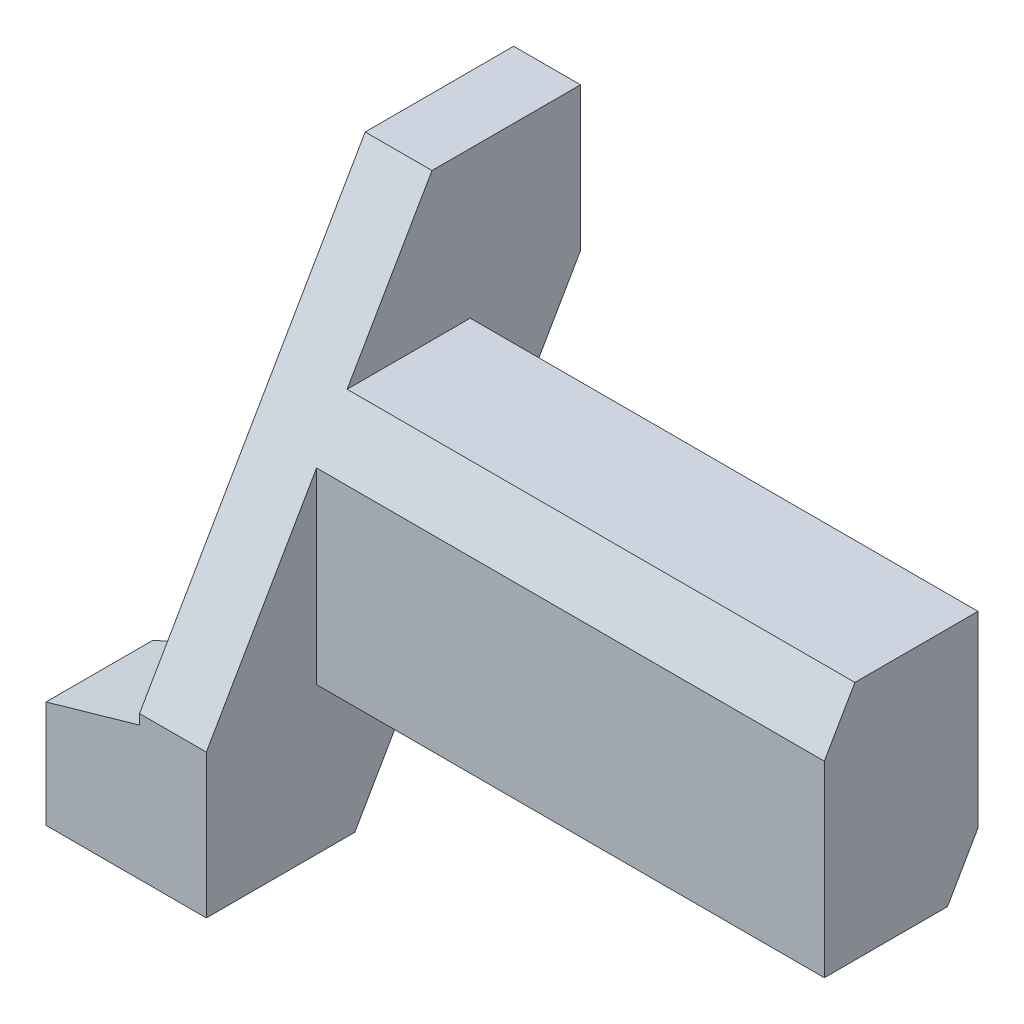
ISO-10303-21;
HEADER;
FILE_DESCRIPTION(('STEP AP214'),'2;1');
FILE_NAME('part.step','',(''),(''),'','','');
FILE_SCHEMA(('AUTOMOTIVE_DESIGN { 1 0 10303 214 1 1 1 1 }'));
ENDSEC;
DATA;
#1=APPLICATION_CONTEXT('core data for automotive mechanical design processes');
#2=APPLICATION_PROTOCOL_DEFINITION('international standard','automotive_design',2000,#1);
#3=PRODUCT_CONTEXT('',#1,'mechanical');
#4=PRODUCT('Part','Part','',(#3));
#5=PRODUCT_RELATED_PRODUCT_CATEGORY('part','',(#4));
#6=PRODUCT_DEFINITION_FORMATION('','',#4);
#7=PRODUCT_DEFINITION_CONTEXT('part definition',#1,'design');
#8=PRODUCT_DEFINITION('design','',#6,#7);
#9=PRODUCT_DEFINITION_SHAPE('','',#8);
#10=(LENGTH_UNIT() NAMED_UNIT(*) SI_UNIT(.MILLI.,.METRE.));
#11=(NAMED_UNIT(*) PLANE_ANGLE_UNIT() SI_UNIT($,.RADIAN.));
#12=(NAMED_UNIT(*) SI_UNIT($,.STERADIAN.) SOLID_ANGLE_UNIT());
#13=UNCERTAINTY_MEASURE_WITH_UNIT(LENGTH_MEASURE(1.E-05),#10,'distance_accuracy_value','');
#14=(GEOMETRIC_REPRESENTATION_CONTEXT(3) GLOBAL_UNCERTAINTY_ASSIGNED_CONTEXT((#13)) GLOBAL_UNIT_ASSIGNED_CONTEXT((#10,
#11,#12)) REPRESENTATION_CONTEXT('',''));
#15=CARTESIAN_POINT('',(0.,0.,0.));
#16=DIRECTION('',(0.,0.,1.));
#17=DIRECTION('',(1.,0.,0.));
#18=AXIS2_PLACEMENT_3D('',#15,#16,#17);
#19=CARTESIAN_POINT('',(0.,0.,0.));
#20=DIRECTION('',(-1.,0.,0.));
#21=DIRECTION('',(0.,0.,1.));
#22=AXIS2_PLACEMENT_3D('',#19,#20,#21);
#23=PLANE('',#22);
#24=DIRECTION('',(0.,0.,-1.));
#25=VECTOR('',#24,1.);
#26=CARTESIAN_POINT('',(0.,-18.,11.5));
#27=LINE('',#26,#25);
#28=CARTESIAN_POINT('',(0.,-18.,11.5));
#29=VERTEX_POINT('',#28);
#30=CARTESIAN_POINT('',(0.,-18.,-6.92820323027691));
#31=VERTEX_POINT('',#30);
#32=EDGE_CURVE('E59',#29,#31,#27,.T.);
#33=ORIENTED_EDGE('',*,*,#32,.F.);
#34=DIRECTION('',(0.,-1.,0.));
#35=VECTOR('',#34,1.);
#36=CARTESIAN_POINT('',(0.,-18.,11.5));
#37=LINE('',#36,#35);
#38=CARTESIAN_POINT('',(0.,10.0814157129556,11.5));
#39=VERTEX_POINT('',#38);
#40=EDGE_CURVE('E196',#39,#29,#37,.T.);
#41=ORIENTED_EDGE('',*,*,#40,.F.);
#42=DIRECTION('',(0.,-0.86602540378444,0.499999999999998));
#43=VECTOR('',#42,1.);
#44=CARTESIAN_POINT('',(0.,-18.497422611931,28.));
#45=LINE('',#44,#43);
#46=CARTESIAN_POINT('',(0.,-18.497422611931,28.));
#47=VERTEX_POINT('',#46);
#48=EDGE_CURVE('E233',#39,#47,#45,.T.);
#49=ORIENTED_EDGE('',*,*,#48,.T.);
#50=DIRECTION('',(0.,-1.,0.));
#51=VECTOR('',#50,1.);
#52=CARTESIAN_POINT('',(0.,-40.0000000000004,28.));
#53=LINE('',#52,#51);
#54=CARTESIAN_POINT('',(0.,-40.0000000000004,28.));
#55=VERTEX_POINT('',#54);
#56=EDGE_CURVE('E219',#47,#55,#53,.T.);
#57=ORIENTED_EDGE('',*,*,#56,.T.);
#58=DIRECTION('',(0.,0.,-1.));
#59=VECTOR('',#58,1.);
#60=CARTESIAN_POINT('',(0.,-39.9999999999998,5.77350269189466));
#61=LINE('',#60,#59);
#62=CARTESIAN_POINT('',(0.,-39.9999999999998,5.77350269189466));
#63=VERTEX_POINT('',#62);
#64=EDGE_CURVE('E216',#55,#63,#61,.T.);
#65=ORIENTED_EDGE('',*,*,#64,.T.);
#66=DIRECTION('',(0.,0.86602540378444,-0.499999999999998));
#67=VECTOR('',#66,1.);
#68=CARTESIAN_POINT('',(0.,-39.9999999999998,5.77350269189466));
#69=LINE('',#68,#67);
#70=EDGE_CURVE('E225',#63,#31,#69,.T.);
#71=ORIENTED_EDGE('',*,*,#70,.T.);
#72=EDGE_LOOP('',(#33,#41,#49,#57,#65,#71));
#73=FACE_BOUND('',#72,.T.);
#74=ADVANCED_FACE('F36',(#73),#23,.F.);
#75=DIRECTION('',(0.,1.,0.));
#76=VECTOR('',#75,1.);
#77=CARTESIAN_POINT('',(0.,-10.0814157129605,-11.5));
#78=LINE('',#77,#76);
#79=CARTESIAN_POINT('',(0.,-10.0814157129603,-11.5));
#80=VERTEX_POINT('',#79);
#81=CARTESIAN_POINT('',(0.,18.,-11.5));
#82=VERTEX_POINT('',#81);
#83=EDGE_CURVE('E176',#80,#82,#78,.T.);
#84=ORIENTED_EDGE('',*,*,#83,.F.);
#85=CARTESIAN_POINT('',(0.,18.4974226119264,-28.));
#86=VERTEX_POINT('',#85);
#87=EDGE_CURVE('E224',#80,#86,#69,.T.);
#88=ORIENTED_EDGE('',*,*,#87,.T.);
#89=DIRECTION('',(0.,1.,0.));
#90=VECTOR('',#89,1.);
#91=CARTESIAN_POINT('',(0.,18.4974226119264,-28.));
#92=LINE('',#91,#90);
#93=CARTESIAN_POINT('',(0.,40.,-28.));
#94=VERTEX_POINT('',#93);
#95=EDGE_CURVE('E227',#86,#94,#92,.T.);
#96=ORIENTED_EDGE('',*,*,#95,.T.);
#97=DIRECTION('',(0.,0.,1.));
#98=VECTOR('',#97,1.);
#99=CARTESIAN_POINT('',(0.,40.0000000000002,-5.77350269189761));
#100=LINE('',#99,#98);
#101=CARTESIAN_POINT('',(0.,40.0000000000002,-5.77350269189761));
#102=VERTEX_POINT('',#101);
#103=EDGE_CURVE('E230',#94,#102,#100,.T.);
#104=ORIENTED_EDGE('',*,*,#103,.T.);
#105=CARTESIAN_POINT('',(0.,18.,6.92820323027427));
#106=VERTEX_POINT('',#105);
#107=EDGE_CURVE('E234',#102,#106,#45,.T.);
#108=ORIENTED_EDGE('',*,*,#107,.T.);
#109=DIRECTION('',(0.,0.,1.));
#110=VECTOR('',#109,1.);
#111=CARTESIAN_POINT('',(0.,18.,6.92820323027427));
#112=LINE('',#111,#110);
#113=EDGE_CURVE('E193',#82,#106,#112,.T.);
#114=ORIENTED_EDGE('',*,*,#113,.F.);
#115=EDGE_LOOP('',(#84,#88,#96,#104,#108,#114));
#116=FACE_BOUND('',#115,.T.);
#117=ADVANCED_FACE('F277',(#116),#23,.F.);
#118=CARTESIAN_POINT('',(-24.,-39.9999999999998,5.77350269189466));
#119=DIRECTION('',(0.,-1.,0.));
#120=DIRECTION('',(0.,0.,-1.));
#121=AXIS2_PLACEMENT_3D('',#118,#119,#120);
#122=PLANE('',#121);
#123=DIRECTION('',(-0.961523947640823,0.,0.274721127897378));
#124=VECTOR('',#123,1.);
#125=CARTESIAN_POINT('',(-22.35526486201,-40.,11.5300756748596));
#126=LINE('',#125,#124);
#127=CARTESIAN_POINT('',(-9.99999999999999,-39.9999999999998,7.99999999999955));
#128=VERTEX_POINT('',#127);
#129=CARTESIAN_POINT('',(-24.,-40.0000000000004,11.9999999999996));
#130=VERTEX_POINT('',#129);
#131=EDGE_CURVE('E147',#128,#130,#126,.T.);
#132=ORIENTED_EDGE('',*,*,#131,.F.);
#133=DIRECTION('',(0.,0.,1.));
#134=VECTOR('',#133,1.);
#135=CARTESIAN_POINT('',(-9.99999999999999,-39.9999999999998,5.77350269189467));
#136=LINE('',#135,#134);
#137=CARTESIAN_POINT('',(-9.99999999999999,-39.9999999999998,5.77350269189466));
#138=VERTEX_POINT('',#137);
#139=EDGE_CURVE('E141',#138,#128,#136,.T.);
#140=ORIENTED_EDGE('',*,*,#139,.F.);
#141=DIRECTION('',(1.,0.,0.));
#142=VECTOR('',#141,1.);
#143=CARTESIAN_POINT('',(-24.,-39.9999999999998,5.77350269189466));
#144=LINE('',#143,#142);
#145=EDGE_CURVE('E221',#138,#63,#144,.T.);
#146=ORIENTED_EDGE('',*,*,#145,.T.);
#147=ORIENTED_EDGE('',*,*,#64,.F.);
#148=DIRECTION('',(1.,0.,0.));
#149=VECTOR('',#148,1.);
#150=CARTESIAN_POINT('',(-24.,-40.0000000000004,28.));
#151=LINE('',#150,#149);
#152=CARTESIAN_POINT('',(-24.,-40.0000000000004,28.));
#153=VERTEX_POINT('',#152);
#154=EDGE_CURVE('E238',#153,#55,#151,.T.);
#155=ORIENTED_EDGE('',*,*,#154,.F.);
#156=DIRECTION('',(0.,0.,-1.));
#157=VECTOR('',#156,1.);
#158=CARTESIAN_POINT('',(-24.,-39.9999999999998,5.77350269189466));
#159=LINE('',#158,#157);
#160=EDGE_CURVE('E158',#153,#130,#159,.T.);
#161=ORIENTED_EDGE('',*,*,#160,.T.);
#162=EDGE_LOOP('',(#132,#140,#146,#147,#155,#161));
#163=FACE_BOUND('',#162,.T.);
#164=ADVANCED_FACE('F38',(#163),#122,.T.);
#165=CARTESIAN_POINT('',(-24.,-40.0000000000004,28.));
#166=DIRECTION('',(0.,0.,1.));
#167=DIRECTION('',(0.,-1.,0.));
#168=AXIS2_PLACEMENT_3D('',#165,#166,#167);
#169=PLANE('',#168);
#170=DIRECTION('',(0.,1.,0.));
#171=VECTOR('',#170,1.);
#172=CARTESIAN_POINT('',(-9.99999999999999,-40.0000000000004,28.));
#173=LINE('',#172,#171);
#174=CARTESIAN_POINT('',(-9.99999999999999,-20.0000000000004,28.));
#175=VERTEX_POINT('',#174);
#176=CARTESIAN_POINT('',(-9.99999999999999,-18.497422611931,28.));
#177=VERTEX_POINT('',#176);
#178=EDGE_CURVE('E174',#175,#177,#173,.T.);
#179=ORIENTED_EDGE('',*,*,#178,.F.);
#180=DIRECTION('',(0.961523947640823,0.274721127897378,0.));
#181=VECTOR('',#180,1.);
#182=CARTESIAN_POINT('',(-28.2264150943396,-25.2075471698117,28.));
#183=LINE('',#182,#181);
#184=CARTESIAN_POINT('',(-24.,-24.0000000000004,28.));
#185=VERTEX_POINT('',#184);
#186=EDGE_CURVE('E168',#185,#175,#183,.T.);
#187=ORIENTED_EDGE('',*,*,#186,.F.);
#188=DIRECTION('',(0.,-1.,0.));
#189=VECTOR('',#188,1.);
#190=CARTESIAN_POINT('',(-24.,-40.0000000000004,28.));
#191=LINE('',#190,#189);
#192=EDGE_CURVE('E218',#185,#153,#191,.T.);
#193=ORIENTED_EDGE('',*,*,#192,.T.);
#194=ORIENTED_EDGE('',*,*,#154,.T.);
#195=ORIENTED_EDGE('',*,*,#56,.F.);
#196=DIRECTION('',(1.,0.,0.));
#197=VECTOR('',#196,1.);
#198=CARTESIAN_POINT('',(-24.,-18.497422611931,28.));
#199=LINE('',#198,#197);
#200=EDGE_CURVE('E241',#177,#47,#199,.T.);
#201=ORIENTED_EDGE('',*,*,#200,.F.);
#202=EDGE_LOOP('',(#179,#187,#193,#194,#195,#201));
#203=FACE_BOUND('',#202,.T.);
#204=ADVANCED_FACE('F258',(#203),#169,.T.);
#205=CARTESIAN_POINT('',(-24.,-18.497422611931,28.));
#206=DIRECTION('',(0.,0.499999999999998,0.86602540378444));
#207=DIRECTION('',(0.,-0.86602540378444,0.499999999999998));
#208=AXIS2_PLACEMENT_3D('',#205,#206,#207);
#209=PLANE('',#208);
#210=DIRECTION('',(0.,0.86602540378444,-0.499999999999998));
#211=VECTOR('',#210,1.);
#212=CARTESIAN_POINT('',(-9.99999999999999,-18.497422611931,28.));
#213=LINE('',#212,#211);
#214=CARTESIAN_POINT('',(-10.,40.0000000000002,-5.77350269189762));
#215=VERTEX_POINT('',#214);
#216=EDGE_CURVE('E172',#177,#215,#213,.T.);
#217=ORIENTED_EDGE('',*,*,#216,.F.);
#218=ORIENTED_EDGE('',*,*,#200,.T.);
#219=ORIENTED_EDGE('',*,*,#48,.F.);
#220=DIRECTION('',(-1.,0.,0.));
#221=VECTOR('',#220,1.);
#222=CARTESIAN_POINT('',(76.,10.0814157129558,11.5));
#223=LINE('',#222,#221);
#224=CARTESIAN_POINT('',(76.,10.0814157129558,11.5));
#225=VERTEX_POINT('',#224);
#226=EDGE_CURVE('E207',#225,#39,#223,.T.);
#227=ORIENTED_EDGE('',*,*,#226,.F.);
#228=DIRECTION('',(0.,-0.866025403784439,0.5));
#229=VECTOR('',#228,1.);
#230=CARTESIAN_POINT('',(76.,18.,6.92820323027427));
#231=LINE('',#230,#229);
#232=CARTESIAN_POINT('',(76.,18.,6.92820323027427));
#233=VERTEX_POINT('',#232);
#234=EDGE_CURVE('E182',#233,#225,#231,.T.);
#235=ORIENTED_EDGE('',*,*,#234,.F.);
#236=DIRECTION('',(-1.,0.,0.));
#237=VECTOR('',#236,1.);
#238=CARTESIAN_POINT('',(76.,18.,6.92820323027427));
#239=LINE('',#238,#237);
#240=EDGE_CURVE('E210',#233,#106,#239,.T.);
#241=ORIENTED_EDGE('',*,*,#240,.T.);
#242=ORIENTED_EDGE('',*,*,#107,.F.);
#243=DIRECTION('',(1.,0.,0.));
#244=VECTOR('',#243,1.);
#245=CARTESIAN_POINT('',(-24.,40.0000000000002,-5.77350269189761));
#246=LINE('',#245,#244);
#247=EDGE_CURVE('E243',#215,#102,#246,.T.);
#248=ORIENTED_EDGE('',*,*,#247,.F.);
#249=EDGE_LOOP('',(#217,#218,#219,#227,#235,#241,#242,#248));
#250=FACE_BOUND('',#249,.T.);
#251=ADVANCED_FACE('F285',(#250),#209,.T.);
#252=CARTESIAN_POINT('',(-24.,40.0000000000002,-5.77350269189761));
#253=DIRECTION('',(0.,1.,0.));
#254=DIRECTION('',(0.,0.,1.));
#255=AXIS2_PLACEMENT_3D('',#252,#253,#254);
#256=PLANE('',#255);
#257=DIRECTION('',(0.,0.,1.));
#258=VECTOR('',#257,1.);
#259=CARTESIAN_POINT('',(-10.,40.0000000000002,-28.));
#260=LINE('',#259,#258);
#261=CARTESIAN_POINT('',(-10.,40.0000000000002,-28.));
#262=VERTEX_POINT('',#261);
#263=EDGE_CURVE('E165',#262,#215,#260,.T.);
#264=ORIENTED_EDGE('',*,*,#263,.T.);
#265=ORIENTED_EDGE('',*,*,#247,.T.);
#266=ORIENTED_EDGE('',*,*,#103,.F.);
#267=DIRECTION('',(1.,0.,0.));
#268=VECTOR('',#267,1.);
#269=CARTESIAN_POINT('',(-24.,40.,-28.));
#270=LINE('',#269,#268);
#271=EDGE_CURVE('E245',#262,#94,#270,.T.);
#272=ORIENTED_EDGE('',*,*,#271,.F.);
#273=EDGE_LOOP('',(#264,#265,#266,#272));
#274=FACE_BOUND('',#273,.T.);
#275=ADVANCED_FACE('F288',(#274),#256,.T.);
#276=CARTESIAN_POINT('',(-24.,18.4974226119264,-28.));
#277=DIRECTION('',(0.,0.,-1.));
#278=DIRECTION('',(0.,1.,0.));
#279=AXIS2_PLACEMENT_3D('',#276,#277,#278);
#280=PLANE('',#279);
#281=DIRECTION('',(0.,1.,0.));
#282=VECTOR('',#281,1.);
#283=CARTESIAN_POINT('',(-10.,40.0000000000002,-28.));
#284=LINE('',#283,#282);
#285=CARTESIAN_POINT('',(-9.99999999999999,18.4974226119264,-28.));
#286=VERTEX_POINT('',#285);
#287=EDGE_CURVE('E159',#286,#262,#284,.T.);
#288=ORIENTED_EDGE('',*,*,#287,.T.);
#289=ORIENTED_EDGE('',*,*,#271,.T.);
#290=ORIENTED_EDGE('',*,*,#95,.F.);
#291=DIRECTION('',(1.,0.,0.));
#292=VECTOR('',#291,1.);
#293=CARTESIAN_POINT('',(-24.,18.4974226119264,-28.));
#294=LINE('',#293,#292);
#295=EDGE_CURVE('E247',#286,#86,#294,.T.);
#296=ORIENTED_EDGE('',*,*,#295,.F.);
#297=EDGE_LOOP('',(#288,#289,#290,#296));
#298=FACE_BOUND('',#297,.T.);
#299=ADVANCED_FACE('F273',(#298),#280,.T.);
#300=CARTESIAN_POINT('',(-24.,-39.9999999999998,5.77350269189466));
#301=DIRECTION('',(0.,-0.499999999999998,-0.86602540378444));
#302=DIRECTION('',(0.,0.86602540378444,-0.499999999999998));
#303=AXIS2_PLACEMENT_3D('',#300,#301,#302);
#304=PLANE('',#303);
#305=ORIENTED_EDGE('',*,*,#145,.F.);
#306=DIRECTION('',(0.,-0.86602540378444,0.499999999999998));
#307=VECTOR('',#306,1.);
#308=CARTESIAN_POINT('',(-9.99999999999999,-39.9999999999998,5.77350269189466));
#309=LINE('',#308,#307);
#310=EDGE_CURVE('E44',#286,#138,#309,.T.);
#311=ORIENTED_EDGE('',*,*,#310,.F.);
#312=ORIENTED_EDGE('',*,*,#295,.T.);
#313=ORIENTED_EDGE('',*,*,#87,.F.);
#314=DIRECTION('',(-1.,0.,0.));
#315=VECTOR('',#314,1.);
#316=CARTESIAN_POINT('',(76.,-10.0814157129605,-11.5));
#317=LINE('',#316,#315);
#318=CARTESIAN_POINT('',(76.,-10.0814157129605,-11.5));
#319=VERTEX_POINT('',#318);
#320=EDGE_CURVE('E190',#319,#80,#317,.T.);
#321=ORIENTED_EDGE('',*,*,#320,.F.);
#322=DIRECTION('',(0.,0.866025403784438,-0.5));
#323=VECTOR('',#322,1.);
#324=CARTESIAN_POINT('',(76.,-10.0814157129605,-11.5));
#325=LINE('',#324,#323);
#326=CARTESIAN_POINT('',(76.,-18.,-6.92820323027698));
#327=VERTEX_POINT('',#326);
#328=EDGE_CURVE('E188',#327,#319,#325,.T.);
#329=ORIENTED_EDGE('',*,*,#328,.F.);
#330=DIRECTION('',(-1.,0.,0.));
#331=VECTOR('',#330,1.);
#332=CARTESIAN_POINT('',(76.,-18.,-6.92820323027698));
#333=LINE('',#332,#331);
#334=EDGE_CURVE('E201',#327,#31,#333,.T.);
#335=ORIENTED_EDGE('',*,*,#334,.T.);
#336=ORIENTED_EDGE('',*,*,#70,.F.);
#337=EDGE_LOOP('',(#305,#311,#312,#313,#321,#329,#335,#336));
#338=FACE_BOUND('',#337,.T.);
#339=ADVANCED_FACE('F264',(#338),#304,.T.);
#340=CARTESIAN_POINT('',(-24.,0.,0.));
#341=DIRECTION('',(-1.,0.,0.));
#342=DIRECTION('',(0.,0.,1.));
#343=AXIS2_PLACEMENT_3D('',#340,#341,#342);
#344=PLANE('',#343);
#345=DIRECTION('',(0.,-1.,0.));
#346=VECTOR('',#345,1.);
#347=CARTESIAN_POINT('',(-24.,40.0000000000006,12.0000000000018));
#348=LINE('',#347,#346);
#349=CARTESIAN_POINT('',(-24.,-24.0000000000004,12.));
#350=VERTEX_POINT('',#349);
#351=EDGE_CURVE('E148',#350,#130,#348,.T.);
#352=ORIENTED_EDGE('',*,*,#351,.T.);
#353=ORIENTED_EDGE('',*,*,#160,.F.);
#354=ORIENTED_EDGE('',*,*,#192,.F.);
#355=DIRECTION('',(0.,0.,1.));
#356=VECTOR('',#355,1.);
#357=CARTESIAN_POINT('',(-24.,-24.0000000000004,0.));
#358=LINE('',#357,#356);
#359=EDGE_CURVE('E240',#350,#185,#358,.T.);
#360=ORIENTED_EDGE('',*,*,#359,.F.);
#361=EDGE_LOOP('',(#352,#353,#354,#360));
#362=FACE_BOUND('',#361,.T.);
#363=ADVANCED_FACE('F260',(#362),#344,.T.);
#364=CARTESIAN_POINT('',(76.,-10.0814157129605,-11.5));
#365=DIRECTION('',(0.,0.,1.));
#366=DIRECTION('',(0.,-1.,0.));
#367=AXIS2_PLACEMENT_3D('',#364,#365,#366);
#368=PLANE('',#367);
#369=ORIENTED_EDGE('',*,*,#83,.T.);
#370=DIRECTION('',(-1.,0.,0.));
#371=VECTOR('',#370,1.);
#372=CARTESIAN_POINT('',(76.,18.,-11.5));
#373=LINE('',#372,#371);
#374=CARTESIAN_POINT('',(76.,18.,-11.5));
#375=VERTEX_POINT('',#374);
#376=EDGE_CURVE('E213',#375,#82,#373,.T.);
#377=ORIENTED_EDGE('',*,*,#376,.F.);
#378=DIRECTION('',(0.,1.,0.));
#379=VECTOR('',#378,1.);
#380=CARTESIAN_POINT('',(76.,-10.0814157129605,-11.5));
#381=LINE('',#380,#379);
#382=EDGE_CURVE('E177',#319,#375,#381,.T.);
#383=ORIENTED_EDGE('',*,*,#382,.F.);
#384=ORIENTED_EDGE('',*,*,#320,.T.);
#385=EDGE_LOOP('',(#369,#377,#383,#384));
#386=FACE_BOUND('',#385,.T.);
#387=ADVANCED_FACE('F263',(#386),#368,.F.);
#388=CARTESIAN_POINT('',(76.,18.,6.92820323027427));
#389=DIRECTION('',(0.,-1.,0.));
#390=DIRECTION('',(0.,0.,-1.));
#391=AXIS2_PLACEMENT_3D('',#388,#389,#390);
#392=PLANE('',#391);
#393=ORIENTED_EDGE('',*,*,#113,.T.);
#394=ORIENTED_EDGE('',*,*,#240,.F.);
#395=DIRECTION('',(0.,0.,1.));
#396=VECTOR('',#395,1.);
#397=CARTESIAN_POINT('',(76.,18.,6.92820323027427));
#398=LINE('',#397,#396);
#399=EDGE_CURVE('E180',#375,#233,#398,.T.);
#400=ORIENTED_EDGE('',*,*,#399,.F.);
#401=ORIENTED_EDGE('',*,*,#376,.T.);
#402=EDGE_LOOP('',(#393,#394,#400,#401));
#403=FACE_BOUND('',#402,.T.);
#404=ADVANCED_FACE('F270',(#403),#392,.F.);
#405=CARTESIAN_POINT('',(76.,-18.,11.5));
#406=DIRECTION('',(0.,0.,-1.));
#407=DIRECTION('',(0.,1.,0.));
#408=AXIS2_PLACEMENT_3D('',#405,#406,#407);
#409=PLANE('',#408);
#410=ORIENTED_EDGE('',*,*,#40,.T.);
#411=DIRECTION('',(-1.,0.,0.));
#412=VECTOR('',#411,1.);
#413=CARTESIAN_POINT('',(76.,-18.,11.5));
#414=LINE('',#413,#412);
#415=CARTESIAN_POINT('',(76.,-18.,11.5));
#416=VERTEX_POINT('',#415);
#417=EDGE_CURVE('E204',#416,#29,#414,.T.);
#418=ORIENTED_EDGE('',*,*,#417,.F.);
#419=DIRECTION('',(0.,-1.,0.));
#420=VECTOR('',#419,1.);
#421=CARTESIAN_POINT('',(76.,-18.,11.5));
#422=LINE('',#421,#420);
#423=EDGE_CURVE('E184',#225,#416,#422,.T.);
#424=ORIENTED_EDGE('',*,*,#423,.F.);
#425=ORIENTED_EDGE('',*,*,#226,.T.);
#426=EDGE_LOOP('',(#410,#418,#424,#425));
#427=FACE_BOUND('',#426,.T.);
#428=ADVANCED_FACE('F320',(#427),#409,.F.);
#429=CARTESIAN_POINT('',(76.,-18.,11.5));
#430=DIRECTION('',(0.,1.,0.));
#431=DIRECTION('',(0.,0.,1.));
#432=AXIS2_PLACEMENT_3D('',#429,#430,#431);
#433=PLANE('',#432);
#434=ORIENTED_EDGE('',*,*,#32,.T.);
#435=ORIENTED_EDGE('',*,*,#334,.F.);
#436=DIRECTION('',(0.,0.,-1.));
#437=VECTOR('',#436,1.);
#438=CARTESIAN_POINT('',(76.,-18.,11.5));
#439=LINE('',#438,#437);
#440=EDGE_CURVE('E186',#416,#327,#439,.T.);
#441=ORIENTED_EDGE('',*,*,#440,.F.);
#442=ORIENTED_EDGE('',*,*,#417,.T.);
#443=EDGE_LOOP('',(#434,#435,#441,#442));
#444=FACE_BOUND('',#443,.T.);
#445=ADVANCED_FACE('F316',(#444),#433,.F.);
#446=CARTESIAN_POINT('',(76.,0.,0.));
#447=DIRECTION('',(-1.,0.,0.));
#448=DIRECTION('',(0.,0.,1.));
#449=AXIS2_PLACEMENT_3D('',#446,#447,#448);
#450=PLANE('',#449);
#451=ORIENTED_EDGE('',*,*,#382,.T.);
#452=ORIENTED_EDGE('',*,*,#399,.T.);
#453=ORIENTED_EDGE('',*,*,#234,.T.);
#454=ORIENTED_EDGE('',*,*,#423,.T.);
#455=ORIENTED_EDGE('',*,*,#440,.T.);
#456=ORIENTED_EDGE('',*,*,#328,.T.);
#457=EDGE_LOOP('',(#451,#452,#453,#454,#455,#456));
#458=FACE_BOUND('',#457,.T.);
#459=ADVANCED_FACE('F310',(#458),#450,.F.);
#460=CARTESIAN_POINT('',(-10.,40.0000000000002,-28.));
#461=DIRECTION('',(1.,0.,0.));
#462=DIRECTION('',(0.,1.,0.));
#463=AXIS2_PLACEMENT_3D('',#460,#461,#462);
#464=PLANE('',#463);
#465=ORIENTED_EDGE('',*,*,#216,.T.);
#466=ORIENTED_EDGE('',*,*,#263,.F.);
#467=ORIENTED_EDGE('',*,*,#287,.F.);
#468=ORIENTED_EDGE('',*,*,#310,.T.);
#469=ORIENTED_EDGE('',*,*,#139,.T.);
#470=DIRECTION('',(0.,-1.,0.));
#471=VECTOR('',#470,1.);
#472=CARTESIAN_POINT('',(-9.99999999999999,40.0000000000007,8.00000000000177));
#473=LINE('',#472,#471);
#474=CARTESIAN_POINT('',(-9.99999999999999,-20.0000000000004,8.00000000000176));
#475=VERTEX_POINT('',#474);
#476=EDGE_CURVE('E51',#475,#128,#473,.T.);
#477=ORIENTED_EDGE('',*,*,#476,.F.);
#478=DIRECTION('',(0.,0.,1.));
#479=VECTOR('',#478,1.);
#480=CARTESIAN_POINT('',(-9.99999999999999,-20.0000000000004,-28.));
#481=LINE('',#480,#479);
#482=EDGE_CURVE('E162',#475,#175,#481,.T.);
#483=ORIENTED_EDGE('',*,*,#482,.T.);
#484=ORIENTED_EDGE('',*,*,#178,.T.);
#485=EDGE_LOOP('',(#465,#466,#467,#468,#469,#477,#483,#484));
#486=FACE_BOUND('',#485,.T.);
#487=ADVANCED_FACE('F142',(#486),#464,.F.);
#488=CARTESIAN_POINT('',(-9.99999999999999,-20.0000000000004,-28.));
#489=DIRECTION('',(0.274721127897378,-0.961523947640823,0.));
#490=DIRECTION('',(0.961523947640823,0.274721127897378,0.));
#491=AXIS2_PLACEMENT_3D('',#488,#489,#490);
#492=PLANE('',#491);
#493=ORIENTED_EDGE('',*,*,#482,.F.);
#494=DIRECTION('',(-0.927172649945533,-0.264906471413009,0.264906471413002));
#495=VECTOR('',#494,1.);
#496=CARTESIAN_POINT('',(-1.15789473684227,-17.4736842105268,5.47368421052654));
#497=LINE('',#496,#495);
#498=EDGE_CURVE('E12',#475,#350,#497,.T.);
#499=ORIENTED_EDGE('',*,*,#498,.T.);
#500=ORIENTED_EDGE('',*,*,#359,.T.);
#501=ORIENTED_EDGE('',*,*,#186,.T.);
#502=EDGE_LOOP('',(#493,#499,#500,#501));
#503=FACE_BOUND('',#502,.T.);
#504=ADVANCED_FACE('F253',(#503),#492,.F.);
#505=CARTESIAN_POINT('',(-9.99999999999999,40.0000000000007,8.00000000000177));
#506=DIRECTION('',(0.274721127897378,0.,0.961523947640823));
#507=DIRECTION('',(0.961523947640823,0.,-0.274721127897378));
#508=AXIS2_PLACEMENT_3D('',#505,#506,#507);
#509=PLANE('',#508);
#510=ORIENTED_EDGE('',*,*,#131,.T.);
#511=ORIENTED_EDGE('',*,*,#351,.F.);
#512=ORIENTED_EDGE('',*,*,#498,.F.);
#513=ORIENTED_EDGE('',*,*,#476,.T.);
#514=EDGE_LOOP('',(#510,#511,#512,#513));
#515=FACE_BOUND('',#514,.T.);
#516=ADVANCED_FACE('F151',(#515),#509,.F.);
#517=CLOSED_SHELL('',(#74,#117,#164,#204,#251,#275,#299,#339,#363,#387,#404,#428,#445,#459,#487,
#504,#516));
#518=MANIFOLD_SOLID_BREP('B2',#517);
#519=ADVANCED_BREP_SHAPE_REPRESENTATION('',(#18,#518),#14);
#520=SHAPE_DEFINITION_REPRESENTATION(#9,#519);
ENDSEC;
END-ISO-10303-21;
